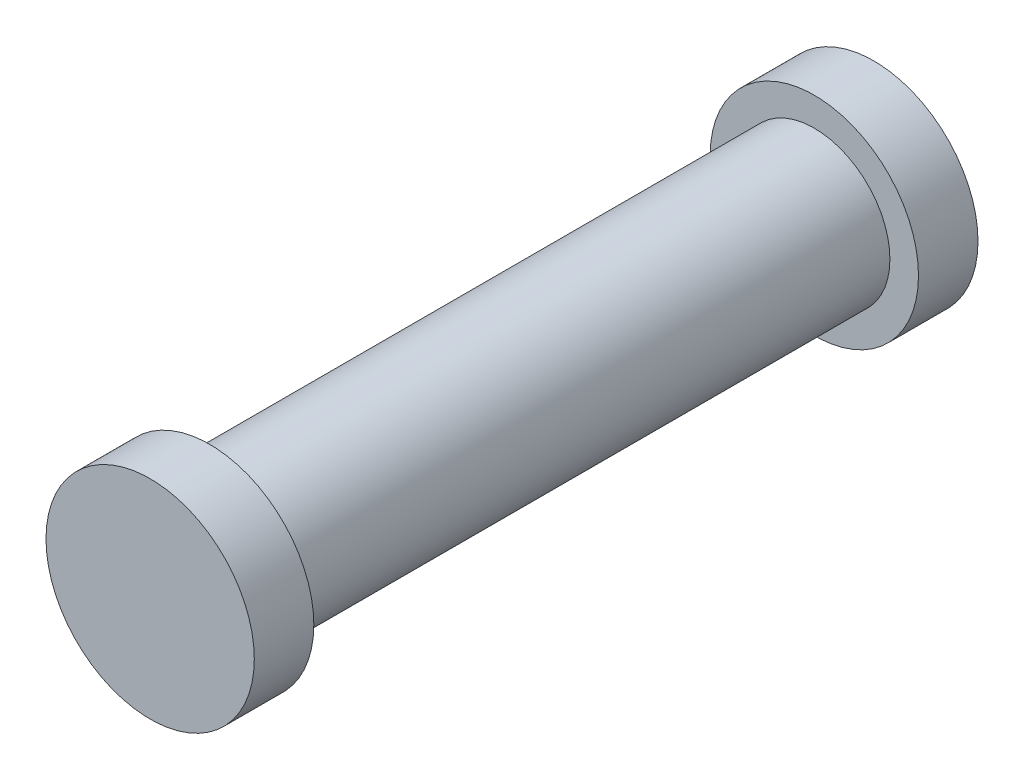
ISO-10303-21;
HEADER;
FILE_DESCRIPTION(('STEP AP214'),'2;1');
FILE_NAME('part.step','',(''),(''),'','','');
FILE_SCHEMA(('AUTOMOTIVE_DESIGN { 1 0 10303 214 1 1 1 1 }'));
ENDSEC;
DATA;
#1=APPLICATION_CONTEXT('core data for automotive mechanical design processes');
#2=APPLICATION_PROTOCOL_DEFINITION('international standard','automotive_design',2000,#1);
#3=PRODUCT_CONTEXT('',#1,'mechanical');
#4=PRODUCT('Part','Part','',(#3));
#5=PRODUCT_RELATED_PRODUCT_CATEGORY('part','',(#4));
#6=PRODUCT_DEFINITION_FORMATION('','',#4);
#7=PRODUCT_DEFINITION_CONTEXT('part definition',#1,'design');
#8=PRODUCT_DEFINITION('design','',#6,#7);
#9=PRODUCT_DEFINITION_SHAPE('','',#8);
#10=(LENGTH_UNIT() NAMED_UNIT(*) SI_UNIT(.MILLI.,.METRE.));
#11=(NAMED_UNIT(*) PLANE_ANGLE_UNIT() SI_UNIT($,.RADIAN.));
#12=(NAMED_UNIT(*) SI_UNIT($,.STERADIAN.) SOLID_ANGLE_UNIT());
#13=UNCERTAINTY_MEASURE_WITH_UNIT(LENGTH_MEASURE(1.E-05),#10,'distance_accuracy_value','');
#14=(GEOMETRIC_REPRESENTATION_CONTEXT(3) GLOBAL_UNCERTAINTY_ASSIGNED_CONTEXT((#13)) GLOBAL_UNIT_ASSIGNED_CONTEXT((#10,
#11,#12)) REPRESENTATION_CONTEXT('',''));
#15=CARTESIAN_POINT('',(0.,0.,0.));
#16=DIRECTION('',(0.,0.,1.));
#17=DIRECTION('',(1.,0.,0.));
#18=AXIS2_PLACEMENT_3D('',#15,#16,#17);
#19=CARTESIAN_POINT('',(0.,0.,50.8));
#20=DIRECTION('',(0.,0.,-1.));
#21=DIRECTION('',(-1.,0.,0.));
#22=AXIS2_PLACEMENT_3D('',#19,#20,#21);
#23=CYLINDRICAL_SURFACE('',#22,12.7);
#24=CARTESIAN_POINT('',(0.,0.,50.8));
#25=DIRECTION('',(0.,0.,1.));
#26=DIRECTION('',(1.,0.,0.));
#27=AXIS2_PLACEMENT_3D('',#24,#25,#26);
#28=CIRCLE('',#27,12.7);
#29=CARTESIAN_POINT('',(12.7,0.,50.8));
#30=VERTEX_POINT('',#29);
#31=EDGE_CURVE('E10',#30,#30,#28,.T.);
#32=ORIENTED_EDGE('',*,*,#31,.F.);
#33=EDGE_LOOP('',(#32));
#34=FACE_BOUND('',#33,.T.);
#35=CARTESIAN_POINT('',(0.,0.,-50.8));
#36=DIRECTION('',(0.,0.,1.));
#37=DIRECTION('',(1.,0.,0.));
#38=AXIS2_PLACEMENT_3D('',#35,#36,#37);
#39=CIRCLE('',#38,12.7);
#40=CARTESIAN_POINT('',(12.7,0.,-50.8));
#41=VERTEX_POINT('',#40);
#42=EDGE_CURVE('E37',#41,#41,#39,.T.);
#43=ORIENTED_EDGE('',*,*,#42,.T.);
#44=EDGE_LOOP('',(#43));
#45=FACE_BOUND('',#44,.T.);
#46=ADVANCED_FACE('F34',(#34,#45),#23,.T.);
#47=CARTESIAN_POINT('',(0.,0.,60.8));
#48=DIRECTION('',(0.,0.,-1.));
#49=DIRECTION('',(-1.,0.,0.));
#50=AXIS2_PLACEMENT_3D('',#47,#48,#49);
#51=CYLINDRICAL_SURFACE('',#50,17.5);
#52=CARTESIAN_POINT('',(0.,0.,60.8));
#53=DIRECTION('',(0.,0.,1.));
#54=DIRECTION('',(1.,0.,0.));
#55=AXIS2_PLACEMENT_3D('',#52,#53,#54);
#56=CIRCLE('',#55,17.5);
#57=CARTESIAN_POINT('',(17.5,0.,60.8));
#58=VERTEX_POINT('',#57);
#59=EDGE_CURVE('E41',#58,#58,#56,.T.);
#60=ORIENTED_EDGE('',*,*,#59,.F.);
#61=EDGE_LOOP('',(#60));
#62=FACE_BOUND('',#61,.T.);
#63=CARTESIAN_POINT('',(0.,0.,50.8));
#64=DIRECTION('',(0.,0.,1.));
#65=DIRECTION('',(1.,0.,0.));
#66=AXIS2_PLACEMENT_3D('',#63,#64,#65);
#67=CIRCLE('',#66,17.5);
#68=CARTESIAN_POINT('',(17.5,0.,50.8));
#69=VERTEX_POINT('',#68);
#70=EDGE_CURVE('E45',#69,#69,#67,.T.);
#71=ORIENTED_EDGE('',*,*,#70,.T.);
#72=EDGE_LOOP('',(#71));
#73=FACE_BOUND('',#72,.T.);
#74=ADVANCED_FACE('F82',(#62,#73),#51,.T.);
#75=CARTESIAN_POINT('',(0.,0.,60.8));
#76=DIRECTION('',(0.,0.,1.));
#77=DIRECTION('',(1.,0.,0.));
#78=AXIS2_PLACEMENT_3D('',#75,#76,#77);
#79=PLANE('',#78);
#80=ORIENTED_EDGE('',*,*,#59,.T.);
#81=EDGE_LOOP('',(#80));
#82=FACE_BOUND('',#81,.T.);
#83=ADVANCED_FACE('F78',(#82),#79,.T.);
#84=CARTESIAN_POINT('',(0.,0.,50.8));
#85=DIRECTION('',(0.,0.,1.));
#86=DIRECTION('',(1.,0.,0.));
#87=AXIS2_PLACEMENT_3D('',#84,#85,#86);
#88=PLANE('',#87);
#89=ORIENTED_EDGE('',*,*,#31,.T.);
#90=EDGE_LOOP('',(#89));
#91=FACE_BOUND('',#90,.T.);
#92=ORIENTED_EDGE('',*,*,#70,.F.);
#93=EDGE_LOOP('',(#92));
#94=FACE_BOUND('',#93,.T.);
#95=ADVANCED_FACE('F70',(#91,#94),#88,.F.);
#96=CARTESIAN_POINT('',(0.,0.,-60.8));
#97=DIRECTION('',(0.,0.,1.));
#98=DIRECTION('',(1.,0.,0.));
#99=AXIS2_PLACEMENT_3D('',#96,#97,#98);
#100=CYLINDRICAL_SURFACE('',#99,17.5);
#101=CARTESIAN_POINT('',(0.,0.,-60.8));
#102=DIRECTION('',(0.,0.,1.));
#103=DIRECTION('',(1.,0.,0.));
#104=AXIS2_PLACEMENT_3D('',#101,#102,#103);
#105=CIRCLE('',#104,17.5);
#106=CARTESIAN_POINT('',(17.5,0.,-60.8));
#107=VERTEX_POINT('',#106);
#108=EDGE_CURVE('E53',#107,#107,#105,.T.);
#109=ORIENTED_EDGE('',*,*,#108,.T.);
#110=EDGE_LOOP('',(#109));
#111=FACE_BOUND('',#110,.T.);
#112=CARTESIAN_POINT('',(0.,0.,-50.8));
#113=DIRECTION('',(0.,0.,1.));
#114=DIRECTION('',(1.,0.,0.));
#115=AXIS2_PLACEMENT_3D('',#112,#113,#114);
#116=CIRCLE('',#115,17.5);
#117=CARTESIAN_POINT('',(17.5,0.,-50.8));
#118=VERTEX_POINT('',#117);
#119=EDGE_CURVE('E50',#118,#118,#116,.T.);
#120=ORIENTED_EDGE('',*,*,#119,.F.);
#121=EDGE_LOOP('',(#120));
#122=FACE_BOUND('',#121,.T.);
#123=ADVANCED_FACE('F68',(#111,#122),#100,.T.);
#124=CARTESIAN_POINT('',(0.,0.,-60.8));
#125=DIRECTION('',(0.,0.,-1.));
#126=DIRECTION('',(1.,0.,0.));
#127=AXIS2_PLACEMENT_3D('',#124,#125,#126);
#128=PLANE('',#127);
#129=ORIENTED_EDGE('',*,*,#108,.F.);
#130=EDGE_LOOP('',(#129));
#131=FACE_BOUND('',#130,.T.);
#132=ADVANCED_FACE('F64',(#131),#128,.T.);
#133=CARTESIAN_POINT('',(0.,0.,-50.8));
#134=DIRECTION('',(0.,0.,-1.));
#135=DIRECTION('',(1.,0.,0.));
#136=AXIS2_PLACEMENT_3D('',#133,#134,#135);
#137=PLANE('',#136);
#138=ORIENTED_EDGE('',*,*,#42,.F.);
#139=EDGE_LOOP('',(#138));
#140=FACE_BOUND('',#139,.T.);
#141=ORIENTED_EDGE('',*,*,#119,.T.);
#142=EDGE_LOOP('',(#141));
#143=FACE_BOUND('',#142,.T.);
#144=ADVANCED_FACE('F61',(#140,#143),#137,.F.);
#145=CLOSED_SHELL('',(#46,#74,#83,#95,#123,#132,#144));
#146=MANIFOLD_SOLID_BREP('B2',#145);
#147=ADVANCED_BREP_SHAPE_REPRESENTATION('',(#18,#146),#14);
#148=SHAPE_DEFINITION_REPRESENTATION(#9,#147);
ENDSEC;
END-ISO-10303-21;
